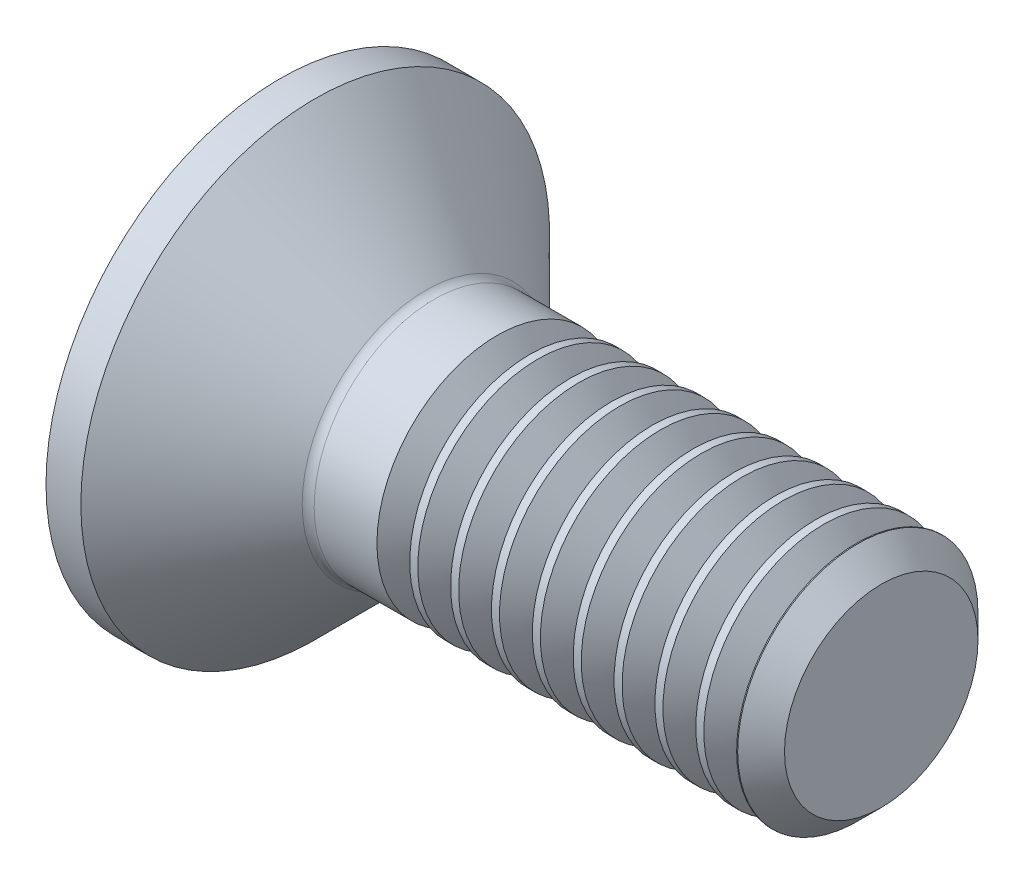
ISO-10303-21;
HEADER;
FILE_DESCRIPTION(('STEP AP214'),'2;1');
FILE_NAME('part.step','',(''),(''),'','','');
FILE_SCHEMA(('AUTOMOTIVE_DESIGN { 1 0 10303 214 1 1 1 1 }'));
ENDSEC;
DATA;
#1=APPLICATION_CONTEXT('core data for automotive mechanical design processes');
#2=APPLICATION_PROTOCOL_DEFINITION('international standard','automotive_design',2000,#1);
#3=PRODUCT_CONTEXT('',#1,'mechanical');
#4=PRODUCT('Part','Part','',(#3));
#5=PRODUCT_RELATED_PRODUCT_CATEGORY('part','',(#4));
#6=PRODUCT_DEFINITION_FORMATION('','',#4);
#7=PRODUCT_DEFINITION_CONTEXT('part definition',#1,'design');
#8=PRODUCT_DEFINITION('design','',#6,#7);
#9=PRODUCT_DEFINITION_SHAPE('','',#8);
#10=(LENGTH_UNIT() NAMED_UNIT(*) SI_UNIT(.MILLI.,.METRE.));
#11=(NAMED_UNIT(*) PLANE_ANGLE_UNIT() SI_UNIT($,.RADIAN.));
#12=(NAMED_UNIT(*) SI_UNIT($,.STERADIAN.) SOLID_ANGLE_UNIT());
#13=UNCERTAINTY_MEASURE_WITH_UNIT(LENGTH_MEASURE(1.E-05),#10,'distance_accuracy_value','');
#14=(GEOMETRIC_REPRESENTATION_CONTEXT(3) GLOBAL_UNCERTAINTY_ASSIGNED_CONTEXT((#13)) GLOBAL_UNIT_ASSIGNED_CONTEXT((#10,
#11,#12)) REPRESENTATION_CONTEXT('',''));
#15=CARTESIAN_POINT('',(0.,0.,0.));
#16=DIRECTION('',(0.,0.,1.));
#17=DIRECTION('',(1.,0.,0.));
#18=AXIS2_PLACEMENT_3D('',#15,#16,#17);
#19=CARTESIAN_POINT('',(6.77236045021345E-12,-4.44089209850063E-13,-4.44089209850063E-13));
#20=DIRECTION('',(-1.,0.,0.));
#21=DIRECTION('',(0.,0.,1.00000000000005));
#22=AXIS2_PLACEMENT_3D('',#19,#20,#21);
#23=PLANE('',#22);
#24=CARTESIAN_POINT('',(6.77236045021345E-12,-4.44089209850063E-13,-4.44089209850063E-13));
#25=DIRECTION('',(-1.,0.,0.));
#26=DIRECTION('',(0.,0.,1.00000000000005));
#27=AXIS2_PLACEMENT_3D('',#24,#25,#26);
#28=CIRCLE('',#27,3.9);
#29=CARTESIAN_POINT('',(6.76196876270296E-12,-3.84986487134142E-13,3.89999999999975));
#30=VERTEX_POINT('',#29);
#31=EDGE_CURVE('E149',#30,#30,#28,.T.);
#32=ORIENTED_EDGE('',*,*,#31,.T.);
#33=EDGE_LOOP('',(#32));
#34=FACE_BOUND('',#33,.T.);
#35=DIRECTION('',(0.,-0.500000000000031,-0.866025403784485));
#36=VECTOR('',#35,1.);
#37=CARTESIAN_POINT('',(6.99440505513849E-12,-0.721687836487961,1.24999999999997));
#38=LINE('',#37,#36);
#39=CARTESIAN_POINT('',(6.99440505513849E-12,-0.721687836487961,1.24999999999997));
#40=VERTEX_POINT('',#39);
#41=CARTESIAN_POINT('',(2.33146835171283E-12,-1.44337567297037,-6.66133814775094E-13));
#42=VERTEX_POINT('',#41);
#43=EDGE_CURVE('E121',#40,#42,#38,.T.);
#44=ORIENTED_EDGE('',*,*,#43,.T.);
#45=DIRECTION('',(0.,0.500000000000004,-0.866025403784473));
#46=VECTOR('',#45,1.);
#47=CARTESIAN_POINT('',(2.33146835171283E-12,-1.44337567297037,-6.66133814775094E-13));
#48=LINE('',#47,#46);
#49=CARTESIAN_POINT('',(2.55351295663786E-12,-0.72168783648463,-1.25000000000197));
#50=VERTEX_POINT('',#49);
#51=EDGE_CURVE('E51',#42,#50,#48,.T.);
#52=ORIENTED_EDGE('',*,*,#51,.T.);
#53=DIRECTION('',(0.,1.00000000000003,0.));
#54=VECTOR('',#53,1.);
#55=CARTESIAN_POINT('',(2.55351295663786E-12,-0.72168783648463,-1.25000000000197));
#56=LINE('',#55,#54);
#57=CARTESIAN_POINT('',(2.77555756156289E-12,0.721687836489071,-1.24999999999909));
#58=VERTEX_POINT('',#57);
#59=EDGE_CURVE('E136',#50,#58,#56,.T.);
#60=ORIENTED_EDGE('',*,*,#59,.T.);
#61=DIRECTION('',(0.,0.500000000000031,0.866025403784486));
#62=VECTOR('',#61,1.);
#63=CARTESIAN_POINT('',(2.77555756156289E-12,0.721687836489071,-1.24999999999909));
#64=LINE('',#63,#62);
#65=CARTESIAN_POINT('',(2.99760216648792E-12,1.44337567297481,0.));
#66=VERTEX_POINT('',#65);
#67=EDGE_CURVE('E725',#58,#66,#64,.T.);
#68=ORIENTED_EDGE('',*,*,#67,.T.);
#69=DIRECTION('',(0.,-0.500000000000002,0.866025403784472));
#70=VECTOR('',#69,1.);
#71=CARTESIAN_POINT('',(2.99760216648792E-12,1.44337567297481,0.));
#72=LINE('',#71,#70);
#73=CARTESIAN_POINT('',(3.66373598126302E-12,0.721687836487961,1.24999999999864));
#74=VERTEX_POINT('',#73);
#75=EDGE_CURVE('E728',#66,#74,#72,.T.);
#76=ORIENTED_EDGE('',*,*,#75,.T.);
#77=DIRECTION('',(0.,-1.00000000000003,0.));
#78=VECTOR('',#77,1.);
#79=CARTESIAN_POINT('',(3.66373598126302E-12,0.721687836487961,1.24999999999864));
#80=LINE('',#79,#78);
#81=EDGE_CURVE('E731',#74,#40,#80,.T.);
#82=ORIENTED_EDGE('',*,*,#81,.T.);
#83=EDGE_LOOP('',(#44,#52,#60,#68,#76,#82));
#84=FACE_BOUND('',#83,.T.);
#85=ADVANCED_FACE('F36',(#34,#84),#23,.T.);
#86=CARTESIAN_POINT('',(6.77236045021345E-12,-4.44089209850063E-13,-4.44089209850063E-13));
#87=DIRECTION('',(-1.,0.,0.));
#88=DIRECTION('',(0.,0.,1.00000000000005));
#89=AXIS2_PLACEMENT_3D('',#86,#87,#88);
#90=CYLINDRICAL_SURFACE('',#89,2.);
#91=CARTESIAN_POINT('',(3.60692006010466,2.22044604925031E-13,4.44089209850063E-13));
#92=DIRECTION('',(-1.,0.,0.));
#93=DIRECTION('',(0.,-1.00000000000003,0.));
#94=AXIS2_PLACEMENT_3D('',#91,#92,#93);
#95=CIRCLE('',#94,2.);
#96=CARTESIAN_POINT('',(3.60692006010465,-1.99999999999984,4.17998968771371E-13));
#97=VERTEX_POINT('',#96);
#98=EDGE_CURVE('E703',#97,#97,#95,.T.);
#99=ORIENTED_EDGE('',*,*,#98,.T.);
#100=EDGE_LOOP('',(#99));
#101=FACE_BOUND('',#100,.T.);
#102=CARTESIAN_POINT('',(2.56284271248142,2.44249065417534E-12,2.22044604925031E-13));
#103=DIRECTION('',(-1.,0.,0.));
#104=DIRECTION('',(0.,0.,1.00000000000005));
#105=AXIS2_PLACEMENT_3D('',#102,#103,#104);
#106=CIRCLE('',#105,2.);
#107=CARTESIAN_POINT('',(2.56284271248141,2.47279974274761E-12,2.00000000000032));
#108=VERTEX_POINT('',#107);
#109=EDGE_CURVE('E11',#108,#108,#106,.F.);
#110=ORIENTED_EDGE('',*,*,#109,.T.);
#111=EDGE_LOOP('',(#110));
#112=FACE_BOUND('',#111,.T.);
#113=ADVANCED_FACE('F179',(#101,#112),#90,.T.);
#114=CARTESIAN_POINT('',(0.580000000006131,-4.44089209850063E-13,-4.44089209850063E-13));
#115=DIRECTION('',(-1.,0.,0.));
#116=DIRECTION('',(0.,0.,1.00000000000005));
#117=AXIS2_PLACEMENT_3D('',#114,#115,#116);
#118=CONICAL_SURFACE('',#117,3.9,0.785398163397451);
#119=CARTESIAN_POINT('',(2.42142135624468,2.44249065417534E-12,2.22044604925031E-13));
#120=DIRECTION('',(-1.,0.,0.));
#121=DIRECTION('',(0.,0.,1.00000000000005));
#122=AXIS2_PLACEMENT_3D('',#119,#120,#121);
#123=CIRCLE('',#122,2.05857864376269);
#124=CARTESIAN_POINT('',(2.42142135624467,2.47368747539873E-12,2.05857864376301));
#125=VERTEX_POINT('',#124);
#126=EDGE_CURVE('E44',#125,#125,#123,.T.);
#127=ORIENTED_EDGE('',*,*,#126,.T.);
#128=EDGE_LOOP('',(#127));
#129=FACE_BOUND('',#128,.T.);
#130=CARTESIAN_POINT('',(0.580000000006131,-4.44089209850063E-13,-4.44089209850063E-13));
#131=DIRECTION('',(-1.,0.,0.));
#132=DIRECTION('',(0.,0.,1.00000000000005));
#133=AXIS2_PLACEMENT_3D('',#130,#131,#132);
#134=CIRCLE('',#133,3.9);
#135=CARTESIAN_POINT('',(0.580000000006121,-3.84986487134142E-13,3.89999999999975));
#136=VERTEX_POINT('',#135);
#137=EDGE_CURVE('E153',#136,#136,#134,.T.);
#138=ORIENTED_EDGE('',*,*,#137,.F.);
#139=EDGE_LOOP('',(#138));
#140=FACE_BOUND('',#139,.T.);
#141=ADVANCED_FACE('F164',(#129,#140),#118,.T.);
#142=CARTESIAN_POINT('',(6.77236045021345E-12,-4.44089209850063E-13,-4.44089209850063E-13));
#143=DIRECTION('',(-1.,0.,0.));
#144=DIRECTION('',(0.,0.,1.00000000000005));
#145=AXIS2_PLACEMENT_3D('',#142,#143,#144);
#146=CYLINDRICAL_SURFACE('',#145,3.9);
#147=ORIENTED_EDGE('',*,*,#137,.T.);
#148=EDGE_LOOP('',(#147));
#149=FACE_BOUND('',#148,.T.);
#150=ORIENTED_EDGE('',*,*,#31,.F.);
#151=EDGE_LOOP('',(#150));
#152=FACE_BOUND('',#151,.T.);
#153=ADVANCED_FACE('F168',(#149,#152),#146,.T.);
#154=CARTESIAN_POINT('',(2.56284271248142,2.44249065417534E-12,2.22044604925031E-13));
#155=DIRECTION('',(-1.,0.,0.));
#156=DIRECTION('',(0.,0.,1.00000000000005));
#157=AXIS2_PLACEMENT_3D('',#154,#155,#156);
#158=TOROIDAL_SURFACE('',#157,2.2,0.2);
#159=ORIENTED_EDGE('',*,*,#109,.F.);
#160=EDGE_LOOP('',(#159));
#161=FACE_BOUND('',#160,.T.);
#162=ORIENTED_EDGE('',*,*,#126,.F.);
#163=EDGE_LOOP('',(#162));
#164=FACE_BOUND('',#163,.T.);
#165=ADVANCED_FACE('F38',(#161,#164),#158,.F.);
#166=CARTESIAN_POINT('',(1.50000000000283,-1.4433756729737,-4.44089209850063E-13));
#167=DIRECTION('',(0.,0.866025403784475,0.500000000000041));
#168=DIRECTION('',(0.,-0.500000000000002,0.866025403784472));
#169=AXIS2_PLACEMENT_3D('',#166,#167,#168);
#170=PLANE('',#169);
#171=ORIENTED_EDGE('',*,*,#51,.F.);
#172=DIRECTION('',(-1.,0.,0.));
#173=VECTOR('',#172,1.);
#174=CARTESIAN_POINT('',(1.50000000000283,-1.4433756729737,-4.44089209850063E-13));
#175=LINE('',#174,#173);
#176=CARTESIAN_POINT('',(1.50000000000283,-1.4433756729737,-4.44089209850063E-13));
#177=VERTEX_POINT('',#176);
#178=EDGE_CURVE('E722',#177,#42,#175,.T.);
#179=ORIENTED_EDGE('',*,*,#178,.F.);
#180=DIRECTION('',(0.,0.500000000000004,-0.866025403784473));
#181=VECTOR('',#180,1.);
#182=CARTESIAN_POINT('',(1.50000000000283,-1.4433756729737,-4.44089209850063E-13));
#183=LINE('',#182,#181);
#184=CARTESIAN_POINT('',(1.50000000000261,-1.08253175472917,-0.624999999998987));
#185=VERTEX_POINT('',#184);
#186=EDGE_CURVE('E118',#177,#185,#183,.T.);
#187=ORIENTED_EDGE('',*,*,#186,.T.);
#188=CARTESIAN_POINT('',(1.50000000000305,-0.721687836483298,-1.25000000000131));
#189=VERTEX_POINT('',#188);
#190=EDGE_CURVE('E112',#185,#189,#183,.T.);
#191=ORIENTED_EDGE('',*,*,#190,.T.);
#192=DIRECTION('',(-1.,0.,0.));
#193=VECTOR('',#192,1.);
#194=CARTESIAN_POINT('',(1.50000000000305,-0.721687836483298,-1.25000000000131));
#195=LINE('',#194,#193);
#196=EDGE_CURVE('E116',#189,#50,#195,.T.);
#197=ORIENTED_EDGE('',*,*,#196,.T.);
#198=EDGE_LOOP('',(#171,#179,#187,#191,#197));
#199=FACE_BOUND('',#198,.T.);
#200=ADVANCED_FACE('F114',(#199),#170,.T.);
#201=CARTESIAN_POINT('',(1.50000000000305,-0.721687836483298,-1.25000000000131));
#202=DIRECTION('',(0.,0.,1.00000000000005));
#203=DIRECTION('',(0.,-1.00000000000003,0.));
#204=AXIS2_PLACEMENT_3D('',#201,#202,#203);
#205=PLANE('',#204);
#206=ORIENTED_EDGE('',*,*,#59,.F.);
#207=ORIENTED_EDGE('',*,*,#196,.F.);
#208=DIRECTION('',(0.,1.00000000000003,0.));
#209=VECTOR('',#208,1.);
#210=CARTESIAN_POINT('',(1.50000000000305,-0.721687836483298,-1.25000000000131));
#211=LINE('',#210,#209);
#212=CARTESIAN_POINT('',(1.50000000000283,3.99680288865056E-12,-1.24999999999797));
#213=VERTEX_POINT('',#212);
#214=EDGE_CURVE('E124',#189,#213,#211,.T.);
#215=ORIENTED_EDGE('',*,*,#214,.T.);
#216=CARTESIAN_POINT('',(1.5000000000035,0.721687836487295,-1.24999999999864));
#217=VERTEX_POINT('',#216);
#218=EDGE_CURVE('E131',#213,#217,#211,.T.);
#219=ORIENTED_EDGE('',*,*,#218,.T.);
#220=DIRECTION('',(-1.,0.,0.));
#221=VECTOR('',#220,1.);
#222=CARTESIAN_POINT('',(1.5000000000035,0.721687836487295,-1.24999999999864));
#223=LINE('',#222,#221);
#224=EDGE_CURVE('E138',#217,#58,#223,.T.);
#225=ORIENTED_EDGE('',*,*,#224,.T.);
#226=EDGE_LOOP('',(#206,#207,#215,#219,#225));
#227=FACE_BOUND('',#226,.T.);
#228=ADVANCED_FACE('F133',(#227),#205,.T.);
#229=CARTESIAN_POINT('',(1.5000000000035,0.721687836487295,-1.24999999999864));
#230=DIRECTION('',(0.,-0.866025403784459,0.500000000000009));
#231=DIRECTION('',(0.,-0.500000000000031,-0.866025403784486));
#232=AXIS2_PLACEMENT_3D('',#229,#230,#231);
#233=PLANE('',#232);
#234=ORIENTED_EDGE('',*,*,#67,.F.);
#235=ORIENTED_EDGE('',*,*,#224,.F.);
#236=DIRECTION('',(0.,0.500000000000031,0.866025403784486));
#237=VECTOR('',#236,1.);
#238=CARTESIAN_POINT('',(1.5000000000035,0.721687836487295,-1.24999999999864));
#239=LINE('',#238,#237);
#240=CARTESIAN_POINT('',(1.50000000000372,1.08253175473205,-0.625000000002318));
#241=VERTEX_POINT('',#240);
#242=EDGE_CURVE('E709',#217,#241,#239,.T.);
#243=ORIENTED_EDGE('',*,*,#242,.T.);
#244=CARTESIAN_POINT('',(1.50000000000239,1.44337567297637,-1.99840144432528E-12));
#245=VERTEX_POINT('',#244);
#246=EDGE_CURVE('E130',#241,#245,#239,.T.);
#247=ORIENTED_EDGE('',*,*,#246,.T.);
#248=DIRECTION('',(-1.,0.,0.));
#249=VECTOR('',#248,1.);
#250=CARTESIAN_POINT('',(1.50000000000239,1.44337567297637,-1.99840144432528E-12));
#251=LINE('',#250,#249);
#252=EDGE_CURVE('E144',#245,#66,#251,.T.);
#253=ORIENTED_EDGE('',*,*,#252,.T.);
#254=EDGE_LOOP('',(#234,#235,#243,#247,#253));
#255=FACE_BOUND('',#254,.T.);
#256=ADVANCED_FACE('F306',(#255),#233,.T.);
#257=CARTESIAN_POINT('',(1.50000000000239,1.44337567297637,-1.99840144432528E-12));
#258=DIRECTION('',(0.,-0.866025403784475,-0.500000000000038));
#259=DIRECTION('',(0.,0.500000000000002,-0.866025403784472));
#260=AXIS2_PLACEMENT_3D('',#257,#258,#259);
#261=PLANE('',#260);
#262=ORIENTED_EDGE('',*,*,#75,.F.);
#263=ORIENTED_EDGE('',*,*,#252,.F.);
#264=DIRECTION('',(0.,-0.500000000000002,0.866025403784472));
#265=VECTOR('',#264,1.);
#266=CARTESIAN_POINT('',(1.50000000000239,1.44337567297637,-1.99840144432528E-12));
#267=LINE('',#266,#265);
#268=CARTESIAN_POINT('',(1.50000000000372,1.08253175472872,0.624999999998765));
#269=VERTEX_POINT('',#268);
#270=EDGE_CURVE('E59',#245,#269,#267,.T.);
#271=ORIENTED_EDGE('',*,*,#270,.T.);
#272=CARTESIAN_POINT('',(1.50000000000305,0.721687836486407,1.24999999999953));
#273=VERTEX_POINT('',#272);
#274=EDGE_CURVE('E712',#269,#273,#267,.T.);
#275=ORIENTED_EDGE('',*,*,#274,.T.);
#276=DIRECTION('',(-1.,0.,0.));
#277=VECTOR('',#276,1.);
#278=CARTESIAN_POINT('',(1.50000000000305,0.721687836486407,1.24999999999953));
#279=LINE('',#278,#277);
#280=EDGE_CURVE('E740',#273,#74,#279,.T.);
#281=ORIENTED_EDGE('',*,*,#280,.T.);
#282=EDGE_LOOP('',(#262,#263,#271,#275,#281));
#283=FACE_BOUND('',#282,.T.);
#284=ADVANCED_FACE('F302',(#283),#261,.T.);
#285=CARTESIAN_POINT('',(1.50000000000305,0.721687836486407,1.24999999999953));
#286=DIRECTION('',(0.,0.,-1.00000000000005));
#287=DIRECTION('',(0.,1.00000000000003,0.));
#288=AXIS2_PLACEMENT_3D('',#285,#286,#287);
#289=PLANE('',#288);
#290=ORIENTED_EDGE('',*,*,#81,.F.);
#291=ORIENTED_EDGE('',*,*,#280,.F.);
#292=DIRECTION('',(0.,-1.00000000000003,0.));
#293=VECTOR('',#292,1.);
#294=CARTESIAN_POINT('',(1.50000000000305,0.721687836486407,1.24999999999953));
#295=LINE('',#294,#293);
#296=CARTESIAN_POINT('',(1.50000000000305,0.,1.25000000000064));
#297=VERTEX_POINT('',#296);
#298=EDGE_CURVE('E715',#273,#297,#295,.T.);
#299=ORIENTED_EDGE('',*,*,#298,.T.);
#300=CARTESIAN_POINT('',(1.50000000000639,-0.721687836485296,1.25000000000153));
#301=VERTEX_POINT('',#300);
#302=EDGE_CURVE('E714',#297,#301,#295,.T.);
#303=ORIENTED_EDGE('',*,*,#302,.T.);
#304=DIRECTION('',(-1.,0.,0.));
#305=VECTOR('',#304,1.);
#306=CARTESIAN_POINT('',(1.50000000000639,-0.721687836485296,1.25000000000153));
#307=LINE('',#306,#305);
#308=EDGE_CURVE('E737',#301,#40,#307,.T.);
#309=ORIENTED_EDGE('',*,*,#308,.T.);
#310=EDGE_LOOP('',(#290,#291,#299,#303,#309));
#311=FACE_BOUND('',#310,.T.);
#312=ADVANCED_FACE('F298',(#311),#289,.T.);
#313=CARTESIAN_POINT('',(1.50000000000639,-0.721687836485296,1.25000000000153));
#314=DIRECTION('',(0.,0.866025403784459,-0.500000000000009));
#315=DIRECTION('',(0.,0.500000000000031,0.866025403784485));
#316=AXIS2_PLACEMENT_3D('',#313,#314,#315);
#317=PLANE('',#316);
#318=ORIENTED_EDGE('',*,*,#43,.F.);
#319=ORIENTED_EDGE('',*,*,#308,.F.);
#320=DIRECTION('',(0.,-0.500000000000031,-0.866025403784485));
#321=VECTOR('',#320,1.);
#322=CARTESIAN_POINT('',(1.50000000000639,-0.721687836485296,1.25000000000153));
#323=LINE('',#322,#321);
#324=CARTESIAN_POINT('',(1.50000000000305,-1.08253175472917,0.625000000002096));
#325=VERTEX_POINT('',#324);
#326=EDGE_CURVE('E719',#301,#325,#323,.T.);
#327=ORIENTED_EDGE('',*,*,#326,.T.);
#328=EDGE_CURVE('E718',#325,#177,#323,.T.);
#329=ORIENTED_EDGE('',*,*,#328,.T.);
#330=ORIENTED_EDGE('',*,*,#178,.T.);
#331=EDGE_LOOP('',(#318,#319,#327,#329,#330));
#332=FACE_BOUND('',#331,.T.);
#333=ADVANCED_FACE('F293',(#332),#317,.T.);
#334=CARTESIAN_POINT('',(1.50000000000283,-1.4433756729737,-4.44089209850063E-13));
#335=DIRECTION('',(-1.,0.,0.));
#336=DIRECTION('',(0.,0.,1.00000000000005));
#337=AXIS2_PLACEMENT_3D('',#334,#335,#336);
#338=PLANE('',#337);
#339=CARTESIAN_POINT('',(1.50000000000594,2.22044604925031E-13,4.44089209850063E-13));
#340=DIRECTION('',(-1.,0.,0.));
#341=DIRECTION('',(0.,0.,1.00000000000005));
#342=AXIS2_PLACEMENT_3D('',#339,#340,#341);
#343=CIRCLE('',#342,1.25);
#344=EDGE_CURVE('E137',#325,#297,#343,.T.);
#345=ORIENTED_EDGE('',*,*,#344,.F.);
#346=ORIENTED_EDGE('',*,*,#326,.F.);
#347=ORIENTED_EDGE('',*,*,#302,.F.);
#348=EDGE_LOOP('',(#345,#346,#347));
#349=FACE_BOUND('',#348,.T.);
#350=ADVANCED_FACE('F289',(#349),#338,.T.);
#351=EDGE_CURVE('E141',#185,#325,#343,.T.);
#352=ORIENTED_EDGE('',*,*,#351,.F.);
#353=ORIENTED_EDGE('',*,*,#186,.F.);
#354=ORIENTED_EDGE('',*,*,#328,.F.);
#355=EDGE_LOOP('',(#352,#353,#354));
#356=FACE_BOUND('',#355,.T.);
#357=ADVANCED_FACE('F292',(#356),#338,.T.);
#358=EDGE_CURVE('E126',#213,#185,#343,.T.);
#359=ORIENTED_EDGE('',*,*,#358,.F.);
#360=ORIENTED_EDGE('',*,*,#214,.F.);
#361=ORIENTED_EDGE('',*,*,#190,.F.);
#362=EDGE_LOOP('',(#359,#360,#361));
#363=FACE_BOUND('',#362,.T.);
#364=ADVANCED_FACE('F125',(#363),#338,.T.);
#365=EDGE_CURVE('E753',#241,#213,#343,.T.);
#366=ORIENTED_EDGE('',*,*,#365,.F.);
#367=ORIENTED_EDGE('',*,*,#242,.F.);
#368=ORIENTED_EDGE('',*,*,#218,.F.);
#369=EDGE_LOOP('',(#366,#367,#368));
#370=FACE_BOUND('',#369,.T.);
#371=ADVANCED_FACE('F347',(#370),#338,.T.);
#372=EDGE_CURVE('E150',#269,#241,#343,.T.);
#373=ORIENTED_EDGE('',*,*,#372,.F.);
#374=ORIENTED_EDGE('',*,*,#270,.F.);
#375=ORIENTED_EDGE('',*,*,#246,.F.);
#376=EDGE_LOOP('',(#373,#374,#375));
#377=FACE_BOUND('',#376,.T.);
#378=ADVANCED_FACE('F353',(#377),#338,.T.);
#379=EDGE_CURVE('E143',#297,#269,#343,.T.);
#380=ORIENTED_EDGE('',*,*,#379,.F.);
#381=ORIENTED_EDGE('',*,*,#298,.F.);
#382=ORIENTED_EDGE('',*,*,#274,.F.);
#383=EDGE_LOOP('',(#380,#381,#382));
#384=FACE_BOUND('',#383,.T.);
#385=ADVANCED_FACE('F295',(#384),#338,.T.);
#386=CARTESIAN_POINT('',(1.50000000000594,2.22044604925031E-13,4.44089209850063E-13));
#387=DIRECTION('',(-1.,0.,0.));
#388=DIRECTION('',(0.,0.,1.00000000000005));
#389=AXIS2_PLACEMENT_3D('',#386,#387,#388);
#390=CONICAL_SURFACE('',#389,1.25,1.04719755119659);
#391=CARTESIAN_POINT('',(2.22168783649368,3.33066907387547E-12,1.11022302462516E-12));
#392=VERTEX_POINT('',#391);
#393=VERTEX_LOOP('',#392);
#394=FACE_BOUND('',#393,.T.);
#395=ORIENTED_EDGE('',*,*,#379,.T.);
#396=ORIENTED_EDGE('',*,*,#372,.T.);
#397=ORIENTED_EDGE('',*,*,#365,.T.);
#398=ORIENTED_EDGE('',*,*,#358,.T.);
#399=ORIENTED_EDGE('',*,*,#351,.T.);
#400=ORIENTED_EDGE('',*,*,#344,.T.);
#401=EDGE_LOOP('',(#395,#396,#397,#398,#399,#400));
#402=FACE_BOUND('',#401,.T.);
#403=ADVANCED_FACE('F191',(#394,#402),#390,.F.);
#404=CARTESIAN_POINT('',(4.15308193990882,1.77635683940025E-12,4.66293670342566E-12));
#405=DIRECTION('',(1.,0.,0.));
#406=DIRECTION('',(0.,1.00000000000003,0.));
#407=AXIS2_PLACEMENT_3D('',#404,#405,#406);
#408=CONICAL_SURFACE('',#407,2.,0.959931088596881);
#409=CARTESIAN_POINT('',(3.88000100000652,2.22044604925031E-13,4.44089209850063E-13));
#410=DIRECTION('',(-1.,0.,0.));
#411=DIRECTION('',(0.,-1.00000000000003,0.));
#412=AXIS2_PLACEMENT_3D('',#409,#410,#411);
#413=CIRCLE('',#412,1.61);
#414=CARTESIAN_POINT('',(3.88000100000651,-1.60999999999983,4.23086565781716E-13));
#415=VERTEX_POINT('',#414);
#416=EDGE_CURVE('E700',#415,#415,#413,.T.);
#417=ORIENTED_EDGE('',*,*,#416,.F.);
#418=EDGE_LOOP('',(#417));
#419=FACE_BOUND('',#418,.T.);
#420=CARTESIAN_POINT('',(4.15308193990882,1.77635683940025E-12,4.66293670342566E-12));
#421=DIRECTION('',(-1.,0.,0.));
#422=DIRECTION('',(0.,-1.00000000000003,0.));
#423=AXIS2_PLACEMENT_3D('',#420,#421,#422);
#424=CIRCLE('',#423,2.);
#425=CARTESIAN_POINT('',(4.15308193990881,-1.99999999999829,4.63684646234697E-12));
#426=VERTEX_POINT('',#425);
#427=EDGE_CURVE('E706',#426,#426,#424,.T.);
#428=ORIENTED_EDGE('',*,*,#427,.T.);
#429=EDGE_LOOP('',(#428));
#430=FACE_BOUND('',#429,.T.);
#431=ADVANCED_FACE('F284',(#419,#430),#408,.T.);
#432=CARTESIAN_POINT('',(3.88000100000652,2.22044604925031E-13,4.44089209850063E-13));
#433=DIRECTION('',(-1.,0.,0.));
#434=DIRECTION('',(0.,-1.00000000000003,0.));
#435=AXIS2_PLACEMENT_3D('',#432,#433,#434);
#436=CONICAL_SURFACE('',#435,1.61,0.959931088596875);
#437=ORIENTED_EDGE('',*,*,#98,.F.);
#438=EDGE_LOOP('',(#437));
#439=FACE_BOUND('',#438,.T.);
#440=ORIENTED_EDGE('',*,*,#416,.T.);
#441=EDGE_LOOP('',(#440));
#442=FACE_BOUND('',#441,.T.);
#443=ADVANCED_FACE('F281',(#439,#442),#436,.T.);
#444=CARTESIAN_POINT('',(4.28692006010467,2.88657986402541E-12,0.));
#445=DIRECTION('',(-1.,0.,0.));
#446=DIRECTION('',(0.,-1.00000000000003,0.));
#447=AXIS2_PLACEMENT_3D('',#444,#445,#446);
#448=CIRCLE('',#447,2.);
#449=CARTESIAN_POINT('',(4.28692006010466,-1.99999999999718,0.));
#450=VERTEX_POINT('',#449);
#451=EDGE_CURVE('E694',#450,#450,#448,.T.);
#452=ORIENTED_EDGE('',*,*,#451,.T.);
#453=EDGE_LOOP('',(#452));
#454=FACE_BOUND('',#453,.T.);
#455=ORIENTED_EDGE('',*,*,#427,.F.);
#456=EDGE_LOOP('',(#455));
#457=FACE_BOUND('',#456,.T.);
#458=ADVANCED_FACE('F188',(#454,#457),#90,.T.);
#459=CARTESIAN_POINT('',(4.83308193990839,2.44249065417534E-12,2.22044604925031E-13));
#460=DIRECTION('',(1.,0.,0.));
#461=DIRECTION('',(0.,1.00000000000003,0.));
#462=AXIS2_PLACEMENT_3D('',#459,#460,#461);
#463=CONICAL_SURFACE('',#462,2.,0.959931088596881);
#464=CARTESIAN_POINT('',(4.56000100000697,2.88657986402541E-12,0.));
#465=DIRECTION('',(-1.,0.,0.));
#466=DIRECTION('',(0.,-1.00000000000003,0.));
#467=AXIS2_PLACEMENT_3D('',#464,#465,#466);
#468=CIRCLE('',#467,1.61);
#469=CARTESIAN_POINT('',(4.56000100000697,-1.60999999999717,0.));
#470=VERTEX_POINT('',#469);
#471=EDGE_CURVE('E691',#470,#470,#468,.T.);
#472=ORIENTED_EDGE('',*,*,#471,.F.);
#473=EDGE_LOOP('',(#472));
#474=FACE_BOUND('',#473,.T.);
#475=CARTESIAN_POINT('',(4.83308193990839,2.44249065417534E-12,2.22044604925031E-13));
#476=DIRECTION('',(-1.,0.,0.));
#477=DIRECTION('',(0.,-1.00000000000003,0.));
#478=AXIS2_PLACEMENT_3D('',#475,#476,#477);
#479=CIRCLE('',#478,2.);
#480=CARTESIAN_POINT('',(4.83308193990838,-1.99999999999762,1.9595436384634E-13));
#481=VERTEX_POINT('',#480);
#482=EDGE_CURVE('E697',#481,#481,#479,.T.);
#483=ORIENTED_EDGE('',*,*,#482,.T.);
#484=EDGE_LOOP('',(#483));
#485=FACE_BOUND('',#484,.T.);
#486=ADVANCED_FACE('F276',(#474,#485),#463,.T.);
#487=CARTESIAN_POINT('',(4.56000100000697,2.88657986402541E-12,0.));
#488=DIRECTION('',(-1.,0.,0.));
#489=DIRECTION('',(0.,-1.00000000000003,0.));
#490=AXIS2_PLACEMENT_3D('',#487,#488,#489);
#491=CONICAL_SURFACE('',#490,1.61,0.959931088596875);
#492=ORIENTED_EDGE('',*,*,#451,.F.);
#493=EDGE_LOOP('',(#492));
#494=FACE_BOUND('',#493,.T.);
#495=ORIENTED_EDGE('',*,*,#471,.T.);
#496=EDGE_LOOP('',(#495));
#497=FACE_BOUND('',#496,.T.);
#498=ADVANCED_FACE('F273',(#494,#497),#491,.T.);
#499=CARTESIAN_POINT('',(4.96692006010424,3.33066907387547E-12,1.11022302462516E-12));
#500=DIRECTION('',(-1.,0.,0.));
#501=DIRECTION('',(0.,-1.00000000000003,0.));
#502=AXIS2_PLACEMENT_3D('',#499,#500,#501);
#503=CIRCLE('',#502,2.);
#504=CARTESIAN_POINT('',(4.96692006010423,-1.99999999999673,1.08413278354647E-12));
#505=VERTEX_POINT('',#504);
#506=EDGE_CURVE('E685',#505,#505,#503,.T.);
#507=ORIENTED_EDGE('',*,*,#506,.T.);
#508=EDGE_LOOP('',(#507));
#509=FACE_BOUND('',#508,.T.);
#510=ORIENTED_EDGE('',*,*,#482,.F.);
#511=EDGE_LOOP('',(#510));
#512=FACE_BOUND('',#511,.T.);
#513=ADVANCED_FACE('F271',(#509,#512),#90,.T.);
#514=CARTESIAN_POINT('',(5.51308193990885,2.88657986402541E-12,0.));
#515=DIRECTION('',(1.,0.,0.));
#516=DIRECTION('',(0.,1.00000000000003,0.));
#517=AXIS2_PLACEMENT_3D('',#514,#515,#516);
#518=CONICAL_SURFACE('',#517,2.,0.959931088596881);
#519=CARTESIAN_POINT('',(5.24000100000699,5.99520433297585E-12,-1.33226762955019E-12));
#520=DIRECTION('',(-1.,0.,0.));
#521=DIRECTION('',(0.,-1.00000000000003,0.));
#522=AXIS2_PLACEMENT_3D('',#519,#520,#521);
#523=CIRCLE('',#522,1.61);
#524=CARTESIAN_POINT('',(5.24000100000698,-1.60999999999406,-1.35327027361853E-12));
#525=VERTEX_POINT('',#524);
#526=EDGE_CURVE('E682',#525,#525,#523,.T.);
#527=ORIENTED_EDGE('',*,*,#526,.F.);
#528=EDGE_LOOP('',(#527));
#529=FACE_BOUND('',#528,.T.);
#530=CARTESIAN_POINT('',(5.51308193990885,2.88657986402541E-12,0.));
#531=DIRECTION('',(-1.,0.,0.));
#532=DIRECTION('',(0.,-1.00000000000003,0.));
#533=AXIS2_PLACEMENT_3D('',#530,#531,#532);
#534=CIRCLE('',#533,2.);
#535=CARTESIAN_POINT('',(5.51308193990884,-1.99999999999718,0.));
#536=VERTEX_POINT('',#535);
#537=EDGE_CURVE('E688',#536,#536,#534,.T.);
#538=ORIENTED_EDGE('',*,*,#537,.T.);
#539=EDGE_LOOP('',(#538));
#540=FACE_BOUND('',#539,.T.);
#541=ADVANCED_FACE('F267',(#529,#540),#518,.T.);
#542=CARTESIAN_POINT('',(5.24000100000699,5.99520433297585E-12,-1.33226762955019E-12));
#543=DIRECTION('',(-1.,0.,0.));
#544=DIRECTION('',(0.,-1.00000000000003,0.));
#545=AXIS2_PLACEMENT_3D('',#542,#543,#544);
#546=CONICAL_SURFACE('',#545,1.61,0.959931088596875);
#547=ORIENTED_EDGE('',*,*,#506,.F.);
#548=EDGE_LOOP('',(#547));
#549=FACE_BOUND('',#548,.T.);
#550=ORIENTED_EDGE('',*,*,#526,.T.);
#551=EDGE_LOOP('',(#550));
#552=FACE_BOUND('',#551,.T.);
#553=ADVANCED_FACE('F264',(#549,#552),#546,.T.);
#554=CARTESIAN_POINT('',(5.6469200601047,3.99680288865056E-12,-1.33226762955019E-12));
#555=DIRECTION('',(-1.,0.,0.));
#556=DIRECTION('',(0.,-1.00000000000003,0.));
#557=AXIS2_PLACEMENT_3D('',#554,#555,#556);
#558=CIRCLE('',#557,2.);
#559=CARTESIAN_POINT('',(5.64692006010469,-1.99999999999607,-1.35835787062888E-12));
#560=VERTEX_POINT('',#559);
#561=EDGE_CURVE('E676',#560,#560,#558,.T.);
#562=ORIENTED_EDGE('',*,*,#561,.T.);
#563=EDGE_LOOP('',(#562));
#564=FACE_BOUND('',#563,.T.);
#565=ORIENTED_EDGE('',*,*,#537,.F.);
#566=EDGE_LOOP('',(#565));
#567=FACE_BOUND('',#566,.T.);
#568=ADVANCED_FACE('F262',(#564,#567),#90,.T.);
#569=CARTESIAN_POINT('',(6.19308193990842,3.99680288865056E-12,-1.33226762955019E-12));
#570=DIRECTION('',(1.,0.,0.));
#571=DIRECTION('',(0.,1.00000000000003,0.));
#572=AXIS2_PLACEMENT_3D('',#569,#570,#571);
#573=CONICAL_SURFACE('',#572,2.,0.959931088596881);
#574=CARTESIAN_POINT('',(5.92000100000656,3.99680288865056E-12,-1.33226762955019E-12));
#575=DIRECTION('',(-1.,0.,0.));
#576=DIRECTION('',(0.,-1.00000000000003,0.));
#577=AXIS2_PLACEMENT_3D('',#574,#575,#576);
#578=CIRCLE('',#577,1.61);
#579=CARTESIAN_POINT('',(5.92000100000655,-1.60999999999606,-1.35327027361853E-12));
#580=VERTEX_POINT('',#579);
#581=EDGE_CURVE('E673',#580,#580,#578,.T.);
#582=ORIENTED_EDGE('',*,*,#581,.F.);
#583=EDGE_LOOP('',(#582));
#584=FACE_BOUND('',#583,.T.);
#585=CARTESIAN_POINT('',(6.19308193990842,3.99680288865056E-12,-1.33226762955019E-12));
#586=DIRECTION('',(-1.,0.,0.));
#587=DIRECTION('',(0.,-1.00000000000003,0.));
#588=AXIS2_PLACEMENT_3D('',#585,#586,#587);
#589=CIRCLE('',#588,2.);
#590=CARTESIAN_POINT('',(6.19308193990841,-1.99999999999607,-1.35835787062888E-12));
#591=VERTEX_POINT('',#590);
#592=EDGE_CURVE('E679',#591,#591,#589,.T.);
#593=ORIENTED_EDGE('',*,*,#592,.T.);
#594=EDGE_LOOP('',(#593));
#595=FACE_BOUND('',#594,.T.);
#596=ADVANCED_FACE('F258',(#584,#595),#573,.T.);
#597=CARTESIAN_POINT('',(5.92000100000656,3.99680288865056E-12,-1.33226762955019E-12));
#598=DIRECTION('',(-1.,0.,0.));
#599=DIRECTION('',(0.,-1.00000000000003,0.));
#600=AXIS2_PLACEMENT_3D('',#597,#598,#599);
#601=CONICAL_SURFACE('',#600,1.61,0.959931088596875);
#602=ORIENTED_EDGE('',*,*,#561,.F.);
#603=EDGE_LOOP('',(#602));
#604=FACE_BOUND('',#603,.T.);
#605=ORIENTED_EDGE('',*,*,#581,.T.);
#606=EDGE_LOOP('',(#605));
#607=FACE_BOUND('',#606,.T.);
#608=ADVANCED_FACE('F255',(#604,#607),#601,.T.);
#609=CARTESIAN_POINT('',(6.32692006010516,4.88498130835069E-12,1.77635683940025E-12));
#610=DIRECTION('',(-1.,0.,0.));
#611=DIRECTION('',(0.,-1.00000000000003,0.));
#612=AXIS2_PLACEMENT_3D('',#609,#610,#611);
#613=CIRCLE('',#612,2.);
#614=CARTESIAN_POINT('',(6.32692006010515,-1.99999999999518,1.75026659832156E-12));
#615=VERTEX_POINT('',#614);
#616=EDGE_CURVE('E667',#615,#615,#613,.T.);
#617=ORIENTED_EDGE('',*,*,#616,.T.);
#618=EDGE_LOOP('',(#617));
#619=FACE_BOUND('',#618,.T.);
#620=ORIENTED_EDGE('',*,*,#592,.F.);
#621=EDGE_LOOP('',(#620));
#622=FACE_BOUND('',#621,.T.);
#623=ADVANCED_FACE('F253',(#619,#622),#90,.T.);
#624=CARTESIAN_POINT('',(6.87308193990843,3.99680288865056E-12,-1.33226762955019E-12));
#625=DIRECTION('',(1.,0.,0.));
#626=DIRECTION('',(0.,1.00000000000003,0.));
#627=AXIS2_PLACEMENT_3D('',#624,#625,#626);
#628=CONICAL_SURFACE('',#627,2.,0.959931088596881);
#629=CARTESIAN_POINT('',(6.60000100000657,5.99520433297585E-12,-1.33226762955019E-12));
#630=DIRECTION('',(-1.,0.,0.));
#631=DIRECTION('',(0.,-1.00000000000003,0.));
#632=AXIS2_PLACEMENT_3D('',#629,#630,#631);
#633=CIRCLE('',#632,1.61);
#634=CARTESIAN_POINT('',(6.60000100000657,-1.60999999999406,-1.35327027361853E-12));
#635=VERTEX_POINT('',#634);
#636=EDGE_CURVE('E664',#635,#635,#633,.T.);
#637=ORIENTED_EDGE('',*,*,#636,.F.);
#638=EDGE_LOOP('',(#637));
#639=FACE_BOUND('',#638,.T.);
#640=CARTESIAN_POINT('',(6.87308193990843,3.99680288865056E-12,-1.33226762955019E-12));
#641=DIRECTION('',(-1.,0.,0.));
#642=DIRECTION('',(0.,-1.00000000000003,0.));
#643=AXIS2_PLACEMENT_3D('',#640,#641,#642);
#644=CIRCLE('',#643,2.);
#645=CARTESIAN_POINT('',(6.87308193990842,-1.99999999999607,-1.35835787062888E-12));
#646=VERTEX_POINT('',#645);
#647=EDGE_CURVE('E670',#646,#646,#644,.T.);
#648=ORIENTED_EDGE('',*,*,#647,.T.);
#649=EDGE_LOOP('',(#648));
#650=FACE_BOUND('',#649,.T.);
#651=ADVANCED_FACE('F249',(#639,#650),#628,.T.);
#652=CARTESIAN_POINT('',(6.60000100000657,5.99520433297585E-12,-1.33226762955019E-12));
#653=DIRECTION('',(-1.,0.,0.));
#654=DIRECTION('',(0.,-1.00000000000003,0.));
#655=AXIS2_PLACEMENT_3D('',#652,#653,#654);
#656=CONICAL_SURFACE('',#655,1.61,0.959931088596875);
#657=ORIENTED_EDGE('',*,*,#616,.F.);
#658=EDGE_LOOP('',(#657));
#659=FACE_BOUND('',#658,.T.);
#660=ORIENTED_EDGE('',*,*,#636,.T.);
#661=EDGE_LOOP('',(#660));
#662=FACE_BOUND('',#661,.T.);
#663=ADVANCED_FACE('F246',(#659,#662),#656,.T.);
#664=CARTESIAN_POINT('',(7.00692006010473,2.88657986402541E-12,0.));
#665=DIRECTION('',(-1.,0.,0.));
#666=DIRECTION('',(0.,-1.00000000000003,0.));
#667=AXIS2_PLACEMENT_3D('',#664,#665,#666);
#668=CIRCLE('',#667,2.);
#669=CARTESIAN_POINT('',(7.00692006010472,-1.99999999999718,0.));
#670=VERTEX_POINT('',#669);
#671=EDGE_CURVE('E658',#670,#670,#668,.T.);
#672=ORIENTED_EDGE('',*,*,#671,.T.);
#673=EDGE_LOOP('',(#672));
#674=FACE_BOUND('',#673,.T.);
#675=ORIENTED_EDGE('',*,*,#647,.F.);
#676=EDGE_LOOP('',(#675));
#677=FACE_BOUND('',#676,.T.);
#678=ADVANCED_FACE('F244',(#674,#677),#90,.T.);
#679=CARTESIAN_POINT('',(7.553081939908,3.99680288865056E-12,-1.33226762955019E-12));
#680=DIRECTION('',(1.,0.,0.));
#681=DIRECTION('',(0.,1.00000000000003,0.));
#682=AXIS2_PLACEMENT_3D('',#679,#680,#681);
#683=CONICAL_SURFACE('',#682,2.,0.959931088596881);
#684=CARTESIAN_POINT('',(7.28000100000659,3.99680288865056E-12,-1.33226762955019E-12));
#685=DIRECTION('',(-1.,0.,0.));
#686=DIRECTION('',(0.,-1.00000000000003,0.));
#687=AXIS2_PLACEMENT_3D('',#684,#685,#686);
#688=CIRCLE('',#687,1.61);
#689=CARTESIAN_POINT('',(7.28000100000658,-1.60999999999606,-1.35327027361853E-12));
#690=VERTEX_POINT('',#689);
#691=EDGE_CURVE('E655',#690,#690,#688,.T.);
#692=ORIENTED_EDGE('',*,*,#691,.F.);
#693=EDGE_LOOP('',(#692));
#694=FACE_BOUND('',#693,.T.);
#695=CARTESIAN_POINT('',(7.553081939908,3.99680288865056E-12,-1.33226762955019E-12));
#696=DIRECTION('',(-1.,0.,0.));
#697=DIRECTION('',(0.,-1.00000000000003,0.));
#698=AXIS2_PLACEMENT_3D('',#695,#696,#697);
#699=CIRCLE('',#698,2.);
#700=CARTESIAN_POINT('',(7.55308193990799,-1.99999999999607,-1.35835787062888E-12));
#701=VERTEX_POINT('',#700);
#702=EDGE_CURVE('E661',#701,#701,#699,.T.);
#703=ORIENTED_EDGE('',*,*,#702,.T.);
#704=EDGE_LOOP('',(#703));
#705=FACE_BOUND('',#704,.T.);
#706=ADVANCED_FACE('F240',(#694,#705),#683,.T.);
#707=CARTESIAN_POINT('',(7.28000100000659,3.99680288865056E-12,-1.33226762955019E-12));
#708=DIRECTION('',(-1.,0.,0.));
#709=DIRECTION('',(0.,-1.00000000000003,0.));
#710=AXIS2_PLACEMENT_3D('',#707,#708,#709);
#711=CONICAL_SURFACE('',#710,1.61,0.959931088596875);
#712=ORIENTED_EDGE('',*,*,#671,.F.);
#713=EDGE_LOOP('',(#712));
#714=FACE_BOUND('',#713,.T.);
#715=ORIENTED_EDGE('',*,*,#691,.T.);
#716=EDGE_LOOP('',(#715));
#717=FACE_BOUND('',#716,.T.);
#718=ADVANCED_FACE('F237',(#714,#717),#711,.T.);
#719=CARTESIAN_POINT('',(7.6869200601043,2.88657986402541E-12,0.));
#720=DIRECTION('',(-1.,0.,0.));
#721=DIRECTION('',(0.,-1.00000000000003,0.));
#722=AXIS2_PLACEMENT_3D('',#719,#720,#721);
#723=CIRCLE('',#722,2.);
#724=CARTESIAN_POINT('',(7.68692006010429,-1.99999999999718,0.));
#725=VERTEX_POINT('',#724);
#726=EDGE_CURVE('E649',#725,#725,#723,.T.);
#727=ORIENTED_EDGE('',*,*,#726,.T.);
#728=EDGE_LOOP('',(#727));
#729=FACE_BOUND('',#728,.T.);
#730=ORIENTED_EDGE('',*,*,#702,.F.);
#731=EDGE_LOOP('',(#730));
#732=FACE_BOUND('',#731,.T.);
#733=ADVANCED_FACE('F235',(#729,#732),#90,.T.);
#734=CARTESIAN_POINT('',(8.23308193990757,8.88178419700125E-12,3.5527136788005E-12));
#735=DIRECTION('',(1.,0.,0.));
#736=DIRECTION('',(0.,1.00000000000003,0.));
#737=AXIS2_PLACEMENT_3D('',#734,#735,#736);
#738=CONICAL_SURFACE('',#737,2.,0.959931088596881);
#739=CARTESIAN_POINT('',(7.96000100000571,4.44089209850063E-12,2.22044604925031E-12));
#740=DIRECTION('',(-1.,0.,0.));
#741=DIRECTION('',(0.,-1.00000000000003,0.));
#742=AXIS2_PLACEMENT_3D('',#739,#740,#741);
#743=CIRCLE('',#742,1.61);
#744=CARTESIAN_POINT('',(7.9600010000057,-1.60999999999561,2.19944340518197E-12));
#745=VERTEX_POINT('',#744);
#746=EDGE_CURVE('E646',#745,#745,#743,.T.);
#747=ORIENTED_EDGE('',*,*,#746,.F.);
#748=EDGE_LOOP('',(#747));
#749=FACE_BOUND('',#748,.T.);
#750=CARTESIAN_POINT('',(8.23308193990757,8.88178419700125E-12,3.5527136788005E-12));
#751=DIRECTION('',(-1.,0.,0.));
#752=DIRECTION('',(0.,-1.00000000000003,0.));
#753=AXIS2_PLACEMENT_3D('',#750,#751,#752);
#754=CIRCLE('',#753,2.);
#755=CARTESIAN_POINT('',(8.23308193990756,-1.99999999999118,3.52662343772181E-12));
#756=VERTEX_POINT('',#755);
#757=EDGE_CURVE('E652',#756,#756,#754,.T.);
#758=ORIENTED_EDGE('',*,*,#757,.T.);
#759=EDGE_LOOP('',(#758));
#760=FACE_BOUND('',#759,.T.);
#761=ADVANCED_FACE('F231',(#749,#760),#738,.T.);
#762=CARTESIAN_POINT('',(7.96000100000571,4.44089209850063E-12,2.22044604925031E-12));
#763=DIRECTION('',(-1.,0.,0.));
#764=DIRECTION('',(0.,-1.00000000000003,0.));
#765=AXIS2_PLACEMENT_3D('',#762,#763,#764);
#766=CONICAL_SURFACE('',#765,1.61,0.959931088596875);
#767=ORIENTED_EDGE('',*,*,#726,.F.);
#768=EDGE_LOOP('',(#767));
#769=FACE_BOUND('',#768,.T.);
#770=ORIENTED_EDGE('',*,*,#746,.T.);
#771=EDGE_LOOP('',(#770));
#772=FACE_BOUND('',#771,.T.);
#773=ADVANCED_FACE('F228',(#769,#772),#766,.T.);
#774=CARTESIAN_POINT('',(8.36692006010431,4.44089209850063E-12,2.22044604925031E-12));
#775=DIRECTION('',(-1.,0.,0.));
#776=DIRECTION('',(0.,-1.00000000000003,0.));
#777=AXIS2_PLACEMENT_3D('',#774,#775,#776);
#778=CIRCLE('',#777,2.);
#779=CARTESIAN_POINT('',(8.3669200601043,-1.99999999999562,2.19435580817162E-12));
#780=VERTEX_POINT('',#779);
#781=EDGE_CURVE('E634',#780,#780,#778,.T.);
#782=ORIENTED_EDGE('',*,*,#781,.T.);
#783=EDGE_LOOP('',(#782));
#784=FACE_BOUND('',#783,.T.);
#785=ORIENTED_EDGE('',*,*,#757,.F.);
#786=EDGE_LOOP('',(#785));
#787=FACE_BOUND('',#786,.T.);
#788=ADVANCED_FACE('F226',(#784,#787),#90,.T.);
#789=CARTESIAN_POINT('',(8.91308193990714,4.44089209850063E-12,2.22044604925031E-12));
#790=DIRECTION('',(1.,0.,0.));
#791=DIRECTION('',(0.,1.00000000000003,0.));
#792=AXIS2_PLACEMENT_3D('',#789,#790,#791);
#793=CONICAL_SURFACE('',#792,2.,0.959931088596881);
#794=CARTESIAN_POINT('',(8.64000100000661,4.44089209850063E-12,2.22044604925031E-12));
#795=DIRECTION('',(-1.,0.,0.));
#796=DIRECTION('',(0.,-1.00000000000003,0.));
#797=AXIS2_PLACEMENT_3D('',#794,#795,#796);
#798=CIRCLE('',#797,1.61);
#799=CARTESIAN_POINT('',(8.64000100000661,-1.60999999999561,2.19944340518197E-12));
#800=VERTEX_POINT('',#799);
#801=EDGE_CURVE('E630',#800,#800,#798,.T.);
#802=ORIENTED_EDGE('',*,*,#801,.F.);
#803=EDGE_LOOP('',(#802));
#804=FACE_BOUND('',#803,.T.);
#805=CARTESIAN_POINT('',(8.91308193990714,4.44089209850063E-12,2.22044604925031E-12));
#806=DIRECTION('',(-1.,0.,0.));
#807=DIRECTION('',(0.,-1.00000000000003,0.));
#808=AXIS2_PLACEMENT_3D('',#805,#806,#807);
#809=CIRCLE('',#808,2.);
#810=CARTESIAN_POINT('',(8.91308193990713,-1.99999999999562,2.19435580817162E-12));
#811=VERTEX_POINT('',#810);
#812=EDGE_CURVE('E643',#811,#811,#809,.T.);
#813=ORIENTED_EDGE('',*,*,#812,.T.);
#814=EDGE_LOOP('',(#813));
#815=FACE_BOUND('',#814,.T.);
#816=ADVANCED_FACE('F222',(#804,#815),#793,.T.);
#817=CARTESIAN_POINT('',(8.64000100000661,4.44089209850063E-12,2.22044604925031E-12));
#818=DIRECTION('',(-1.,0.,0.));
#819=DIRECTION('',(0.,-1.00000000000003,0.));
#820=AXIS2_PLACEMENT_3D('',#817,#818,#819);
#821=CONICAL_SURFACE('',#820,1.61,0.959931088596875);
#822=ORIENTED_EDGE('',*,*,#781,.F.);
#823=EDGE_LOOP('',(#822));
#824=FACE_BOUND('',#823,.T.);
#825=ORIENTED_EDGE('',*,*,#801,.T.);
#826=EDGE_LOOP('',(#825));
#827=FACE_BOUND('',#826,.T.);
#828=ADVANCED_FACE('F219',(#824,#827),#821,.T.);
#829=CARTESIAN_POINT('',(9.04692006010432,5.10702591327572E-12,4.44089209850063E-12));
#830=DIRECTION('',(-1.,0.,0.));
#831=DIRECTION('',(0.,-1.00000000000003,0.));
#832=AXIS2_PLACEMENT_3D('',#829,#830,#831);
#833=CIRCLE('',#832,2.);
#834=CARTESIAN_POINT('',(9.04692006010432,-1.99999999999496,4.41480185742193E-12));
#835=VERTEX_POINT('',#834);
#836=EDGE_CURVE('E631',#835,#835,#833,.T.);
#837=ORIENTED_EDGE('',*,*,#836,.T.);
#838=EDGE_LOOP('',(#837));
#839=FACE_BOUND('',#838,.T.);
#840=ORIENTED_EDGE('',*,*,#812,.F.);
#841=EDGE_LOOP('',(#840));
#842=FACE_BOUND('',#841,.T.);
#843=ADVANCED_FACE('F213',(#839,#842),#90,.T.);
#844=CARTESIAN_POINT('',(9.59308193990715,5.10702591327572E-12,4.44089209850063E-12));
#845=DIRECTION('',(1.,0.,0.));
#846=DIRECTION('',(0.,1.00000000000003,0.));
#847=AXIS2_PLACEMENT_3D('',#844,#845,#846);
#848=CONICAL_SURFACE('',#847,2.,0.959931088596881);
#849=CARTESIAN_POINT('',(9.32000100000618,7.7715611723761E-12,2.44249065417534E-12));
#850=DIRECTION('',(-1.,0.,0.));
#851=DIRECTION('',(0.,-1.00000000000003,0.));
#852=AXIS2_PLACEMENT_3D('',#849,#850,#851);
#853=CIRCLE('',#852,1.61);
#854=CARTESIAN_POINT('',(9.32000100000618,-1.60999999999228,2.421488010107E-12));
#855=VERTEX_POINT('',#854);
#856=EDGE_CURVE('E637',#855,#855,#853,.T.);
#857=ORIENTED_EDGE('',*,*,#856,.F.);
#858=EDGE_LOOP('',(#857));
#859=FACE_BOUND('',#858,.T.);
#860=CARTESIAN_POINT('',(9.59308193990715,5.10702591327572E-12,4.44089209850063E-12));
#861=DIRECTION('',(-1.,0.,0.));
#862=DIRECTION('',(0.,-1.00000000000003,0.));
#863=AXIS2_PLACEMENT_3D('',#860,#861,#862);
#864=CIRCLE('',#863,2.);
#865=CARTESIAN_POINT('',(9.59308193990715,-1.99999999999496,4.41480185742193E-12));
#866=VERTEX_POINT('',#865);
#867=EDGE_CURVE('E627',#866,#866,#864,.T.);
#868=ORIENTED_EDGE('',*,*,#867,.T.);
#869=EDGE_LOOP('',(#868));
#870=FACE_BOUND('',#869,.T.);
#871=ADVANCED_FACE('F205',(#859,#870),#848,.T.);
#872=CARTESIAN_POINT('',(9.32000100000618,7.7715611723761E-12,2.44249065417534E-12));
#873=DIRECTION('',(-1.,0.,0.));
#874=DIRECTION('',(0.,-1.00000000000003,0.));
#875=AXIS2_PLACEMENT_3D('',#872,#873,#874);
#876=CONICAL_SURFACE('',#875,1.61,0.959931088596875);
#877=ORIENTED_EDGE('',*,*,#836,.F.);
#878=EDGE_LOOP('',(#877));
#879=FACE_BOUND('',#878,.T.);
#880=ORIENTED_EDGE('',*,*,#856,.T.);
#881=EDGE_LOOP('',(#880));
#882=FACE_BOUND('',#881,.T.);
#883=ADVANCED_FACE('F200',(#879,#882),#876,.T.);
#884=CARTESIAN_POINT('',(10.0000000000032,1.61000000001077,4.88498130835069E-12));
#885=DIRECTION('',(1.,0.,0.));
#886=DIRECTION('',(0.,0.,-1.00000000000005));
#887=AXIS2_PLACEMENT_3D('',#884,#885,#886);
#888=PLANE('',#887);
#889=CARTESIAN_POINT('',(10.0000000000057,8.88178419700125E-12,3.5527136788005E-12));
#890=DIRECTION('',(-1.,0.,0.));
#891=DIRECTION('',(0.,0.,1.00000000000005));
#892=AXIS2_PLACEMENT_3D('',#889,#890,#891);
#893=CIRCLE('',#892,1.61);
#894=CARTESIAN_POINT('',(10.0000000000057,8.90618301330193E-12,1.61000000000363));
#895=VERTEX_POINT('',#894);
#896=EDGE_CURVE('E159',#895,#895,#893,.T.);
#897=ORIENTED_EDGE('',*,*,#896,.F.);
#898=EDGE_LOOP('',(#897));
#899=FACE_BOUND('',#898,.T.);
#900=ADVANCED_FACE('F197',(#899),#888,.T.);
#901=CARTESIAN_POINT('',(10.0000000000057,8.88178419700125E-12,3.5527136788005E-12));
#902=DIRECTION('',(-1.,0.,0.));
#903=DIRECTION('',(0.,0.,1.00000000000005));
#904=AXIS2_PLACEMENT_3D('',#901,#902,#903);
#905=CONICAL_SURFACE('',#904,1.61,0.785398163397444);
#906=CARTESIAN_POINT('',(9.61000000000622,4.44089209850063E-12,2.22044604925031E-12));
#907=DIRECTION('',(-1.,0.,0.));
#908=DIRECTION('',(0.,0.,1.00000000000005));
#909=AXIS2_PLACEMENT_3D('',#906,#907,#908);
#910=CIRCLE('',#909,2.);
#911=CARTESIAN_POINT('',(9.61000000000622,4.47120118707289E-12,2.00000000000232));
#912=VERTEX_POINT('',#911);
#913=EDGE_CURVE('E156',#912,#912,#910,.T.);
#914=ORIENTED_EDGE('',*,*,#913,.F.);
#915=EDGE_LOOP('',(#914));
#916=FACE_BOUND('',#915,.T.);
#917=ORIENTED_EDGE('',*,*,#896,.T.);
#918=EDGE_LOOP('',(#917));
#919=FACE_BOUND('',#918,.T.);
#920=ADVANCED_FACE('F195',(#916,#919),#905,.T.);
#921=ORIENTED_EDGE('',*,*,#867,.F.);
#922=EDGE_LOOP('',(#921));
#923=FACE_BOUND('',#922,.T.);
#924=ORIENTED_EDGE('',*,*,#913,.T.);
#925=EDGE_LOOP('',(#924));
#926=FACE_BOUND('',#925,.T.);
#927=ADVANCED_FACE('F187',(#923,#926),#90,.T.);
#928=CLOSED_SHELL('',(#85,#113,#141,#153,#165,#200,#228,#256,#284,#312,#333,#350,#357,#364,#371,
#378,#385,#403,#431,#443,#458,#486,#498,#513,#541,#553,#568,#596,#608,#623,#651,#663,#678,#706,
#718,#733,#761,#773,#788,#816,#828,#843,#871,#883,#900,#920,#927));
#929=MANIFOLD_SOLID_BREP('B2',#928);
#930=ADVANCED_BREP_SHAPE_REPRESENTATION('',(#18,#929),#14);
#931=SHAPE_DEFINITION_REPRESENTATION(#9,#930);
ENDSEC;
END-ISO-10303-21;
